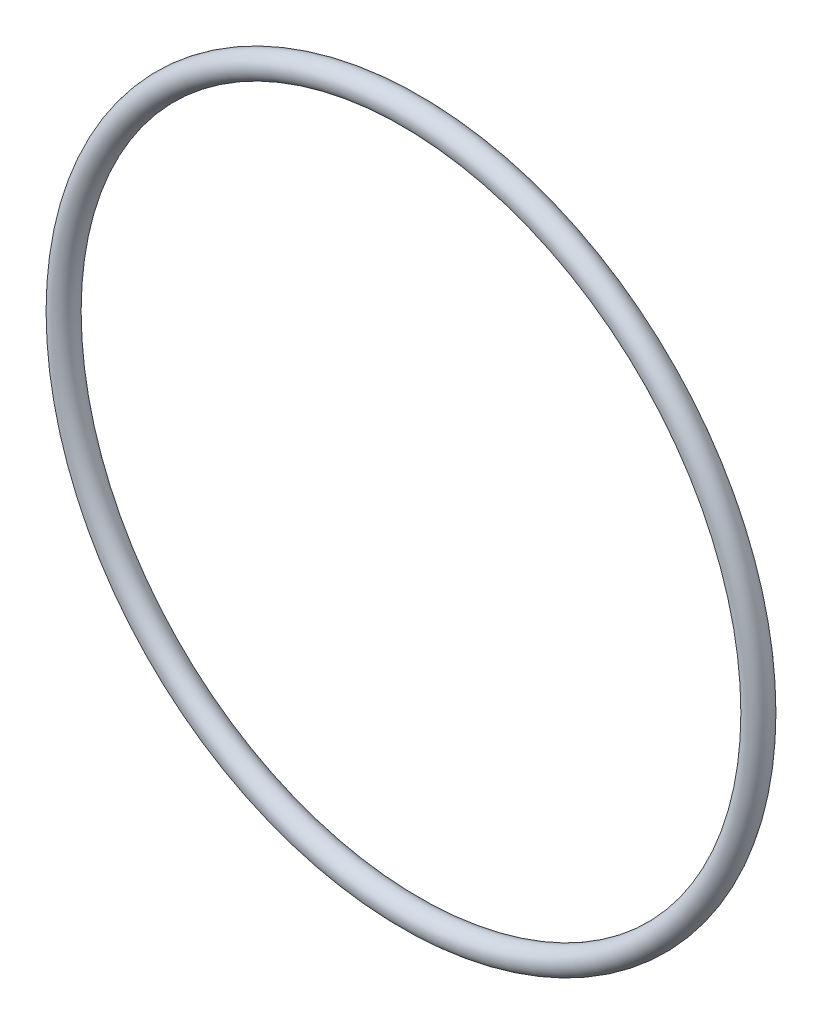
ISO-10303-21;
HEADER;
FILE_DESCRIPTION(('STEP AP214'),'2;1');
FILE_NAME('part.step','',(''),(''),'','','');
FILE_SCHEMA(('AUTOMOTIVE_DESIGN { 1 0 10303 214 1 1 1 1 }'));
ENDSEC;
DATA;
#1=APPLICATION_CONTEXT('core data for automotive mechanical design processes');
#2=APPLICATION_PROTOCOL_DEFINITION('international standard','automotive_design',2000,#1);
#3=PRODUCT_CONTEXT('',#1,'mechanical');
#4=PRODUCT('Part','Part','',(#3));
#5=PRODUCT_RELATED_PRODUCT_CATEGORY('part','',(#4));
#6=PRODUCT_DEFINITION_FORMATION('','',#4);
#7=PRODUCT_DEFINITION_CONTEXT('part definition',#1,'design');
#8=PRODUCT_DEFINITION('design','',#6,#7);
#9=PRODUCT_DEFINITION_SHAPE('','',#8);
#10=(LENGTH_UNIT() NAMED_UNIT(*) SI_UNIT(.MILLI.,.METRE.));
#11=(NAMED_UNIT(*) PLANE_ANGLE_UNIT() SI_UNIT($,.RADIAN.));
#12=(NAMED_UNIT(*) SI_UNIT($,.STERADIAN.) SOLID_ANGLE_UNIT());
#13=UNCERTAINTY_MEASURE_WITH_UNIT(LENGTH_MEASURE(1.E-05),#10,'distance_accuracy_value','');
#14=(GEOMETRIC_REPRESENTATION_CONTEXT(3) GLOBAL_UNCERTAINTY_ASSIGNED_CONTEXT((#13)) GLOBAL_UNIT_ASSIGNED_CONTEXT((#10,
#11,#12)) REPRESENTATION_CONTEXT('',''));
#15=CARTESIAN_POINT('',(0.,0.,0.));
#16=DIRECTION('',(0.,0.,1.));
#17=DIRECTION('',(1.,0.,0.));
#18=AXIS2_PLACEMENT_3D('',#15,#16,#17);
#19=CARTESIAN_POINT('',(0.,0.,2.));
#20=DIRECTION('',(0.,0.,-1.));
#21=DIRECTION('',(-1.,0.,0.));
#22=AXIS2_PLACEMENT_3D('',#19,#20,#21);
#23=TOROIDAL_SURFACE('',#22,1.4,0.0499999999999999);
#24=CARTESIAN_POINT('',(-1.45,0.,2.));
#25=VERTEX_POINT('',#24);
#26=VERTEX_LOOP('',#25);
#27=FACE_BOUND('',#26,.T.);
#28=ADVANCED_FACE('F13',(#27),#23,.T.);
#29=CLOSED_SHELL('',(#28));
#30=MANIFOLD_SOLID_BREP('B1',#29);
#31=ADVANCED_BREP_SHAPE_REPRESENTATION('',(#18,#30),#14);
#32=SHAPE_DEFINITION_REPRESENTATION(#9,#31);
ENDSEC;
END-ISO-10303-21;
